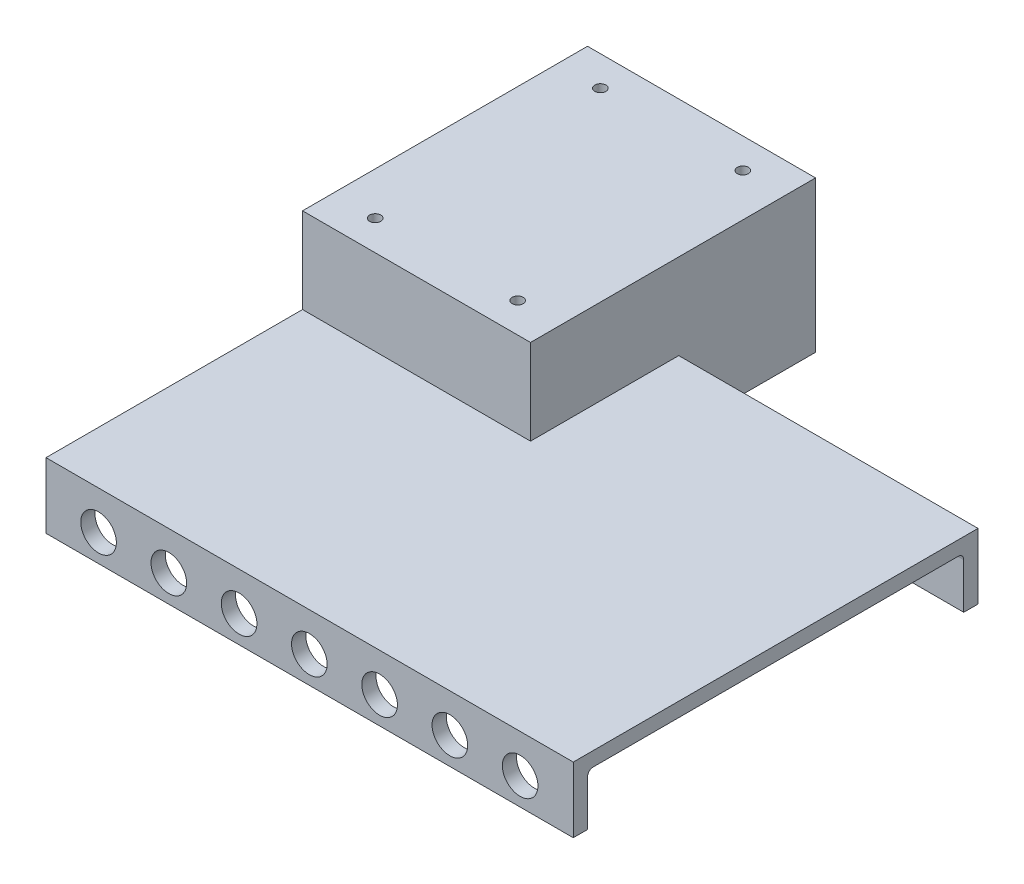
ISO-10303-21;
HEADER;
FILE_DESCRIPTION(('STEP AP214'),'2;1');
FILE_NAME('part.step','',(''),(''),'','','');
FILE_SCHEMA(('AUTOMOTIVE_DESIGN { 1 0 10303 214 1 1 1 1 }'));
ENDSEC;
DATA;
#1=APPLICATION_CONTEXT('core data for automotive mechanical design processes');
#2=APPLICATION_PROTOCOL_DEFINITION('international standard','automotive_design',2000,#1);
#3=PRODUCT_CONTEXT('',#1,'mechanical');
#4=PRODUCT('Part','Part','',(#3));
#5=PRODUCT_RELATED_PRODUCT_CATEGORY('part','',(#4));
#6=PRODUCT_DEFINITION_FORMATION('','',#4);
#7=PRODUCT_DEFINITION_CONTEXT('part definition',#1,'design');
#8=PRODUCT_DEFINITION('design','',#6,#7);
#9=PRODUCT_DEFINITION_SHAPE('','',#8);
#10=(LENGTH_UNIT() NAMED_UNIT(*) SI_UNIT(.MILLI.,.METRE.));
#11=(NAMED_UNIT(*) PLANE_ANGLE_UNIT() SI_UNIT($,.RADIAN.));
#12=(NAMED_UNIT(*) SI_UNIT($,.STERADIAN.) SOLID_ANGLE_UNIT());
#13=UNCERTAINTY_MEASURE_WITH_UNIT(LENGTH_MEASURE(1.E-05),#10,'distance_accuracy_value','');
#14=(GEOMETRIC_REPRESENTATION_CONTEXT(3) GLOBAL_UNCERTAINTY_ASSIGNED_CONTEXT((#13)) GLOBAL_UNIT_ASSIGNED_CONTEXT((#10,
#11,#12)) REPRESENTATION_CONTEXT('',''));
#15=CARTESIAN_POINT('',(0.,0.,0.));
#16=DIRECTION('',(0.,0.,1.));
#17=DIRECTION('',(1.,0.,0.));
#18=AXIS2_PLACEMENT_3D('',#15,#16,#17);
#19=CARTESIAN_POINT('',(0.,23.,0.));
#20=DIRECTION('',(1.,0.,0.));
#21=DIRECTION('',(0.,0.,-1.));
#22=AXIS2_PLACEMENT_3D('',#19,#20,#21);
#23=PLANE('',#22);
#24=DIRECTION('',(0.,-1.,0.));
#25=VECTOR('',#24,1.);
#26=CARTESIAN_POINT('',(0.,23.,-185.));
#27=LINE('',#26,#25);
#28=CARTESIAN_POINT('',(0.,46.,-185.));
#29=VERTEX_POINT('',#28);
#30=CARTESIAN_POINT('',(0.,0.,-185.));
#31=VERTEX_POINT('',#30);
#32=EDGE_CURVE('E223',#29,#31,#27,.T.);
#33=ORIENTED_EDGE('',*,*,#32,.F.);
#34=CARTESIAN_POINT('',(0.,46.,-183.));
#35=DIRECTION('',(1.,0.,0.));
#36=DIRECTION('',(0.,0.,-1.));
#37=AXIS2_PLACEMENT_3D('',#34,#35,#36);
#38=CIRCLE('',#37,2.);
#39=CARTESIAN_POINT('',(0.,48.,-183.));
#40=VERTEX_POINT('',#39);
#41=EDGE_CURVE('E354',#29,#40,#38,.T.);
#42=ORIENTED_EDGE('',*,*,#41,.T.);
#43=DIRECTION('',(0.,0.,1.));
#44=VECTOR('',#43,1.);
#45=CARTESIAN_POINT('',(0.,48.,0.));
#46=LINE('',#45,#44);
#47=CARTESIAN_POINT('',(0.,48.,-97.));
#48=VERTEX_POINT('',#47);
#49=EDGE_CURVE('E235',#40,#48,#46,.T.);
#50=ORIENTED_EDGE('',*,*,#49,.T.);
#51=CARTESIAN_POINT('',(0.,46.,-97.));
#52=DIRECTION('',(1.,0.,0.));
#53=DIRECTION('',(0.,0.,-1.));
#54=AXIS2_PLACEMENT_3D('',#51,#52,#53);
#55=CIRCLE('',#54,2.);
#56=CARTESIAN_POINT('',(0.,46.,-95.));
#57=VERTEX_POINT('',#56);
#58=EDGE_CURVE('E352',#48,#57,#55,.T.);
#59=ORIENTED_EDGE('',*,*,#58,.T.);
#60=DIRECTION('',(0.,-1.,0.));
#61=VECTOR('',#60,1.);
#62=CARTESIAN_POINT('',(0.,53.,-95.));
#63=LINE('',#62,#61);
#64=CARTESIAN_POINT('',(0.,18.,-95.));
#65=VERTEX_POINT('',#64);
#66=EDGE_CURVE('E202',#57,#65,#63,.T.);
#67=ORIENTED_EDGE('',*,*,#66,.T.);
#68=DIRECTION('',(0.,0.,1.));
#69=VECTOR('',#68,1.);
#70=CARTESIAN_POINT('',(0.,18.,0.));
#71=LINE('',#70,#69);
#72=CARTESIAN_POINT('',(0.,18.,-7.));
#73=VERTEX_POINT('',#72);
#74=EDGE_CURVE('E213',#65,#73,#71,.T.);
#75=ORIENTED_EDGE('',*,*,#74,.T.);
#76=CARTESIAN_POINT('',(0.,16.,-7.));
#77=DIRECTION('',(1.,0.,0.));
#78=DIRECTION('',(0.,0.,-1.));
#79=AXIS2_PLACEMENT_3D('',#76,#77,#78);
#80=CIRCLE('',#79,2.);
#81=CARTESIAN_POINT('',(0.,16.,-5.));
#82=VERTEX_POINT('',#81);
#83=EDGE_CURVE('E358',#73,#82,#80,.T.);
#84=ORIENTED_EDGE('',*,*,#83,.T.);
#85=DIRECTION('',(0.,-1.,0.));
#86=VECTOR('',#85,1.);
#87=CARTESIAN_POINT('',(0.,23.,-5.));
#88=LINE('',#87,#86);
#89=CARTESIAN_POINT('',(0.,0.,-5.));
#90=VERTEX_POINT('',#89);
#91=EDGE_CURVE('E229',#82,#90,#88,.T.);
#92=ORIENTED_EDGE('',*,*,#91,.T.);
#93=DIRECTION('',(0.,0.,1.));
#94=VECTOR('',#93,1.);
#95=CARTESIAN_POINT('',(0.,0.,0.));
#96=LINE('',#95,#94);
#97=CARTESIAN_POINT('',(0.,0.,0.));
#98=VERTEX_POINT('',#97);
#99=EDGE_CURVE('E282',#90,#98,#96,.T.);
#100=ORIENTED_EDGE('',*,*,#99,.T.);
#101=DIRECTION('',(0.,-1.,0.));
#102=VECTOR('',#101,1.);
#103=CARTESIAN_POINT('',(0.,23.,0.));
#104=LINE('',#103,#102);
#105=CARTESIAN_POINT('',(0.,23.,0.));
#106=VERTEX_POINT('',#105);
#107=EDGE_CURVE('E308',#106,#98,#104,.T.);
#108=ORIENTED_EDGE('',*,*,#107,.F.);
#109=DIRECTION('',(0.,0.,1.));
#110=VECTOR('',#109,1.);
#111=CARTESIAN_POINT('',(0.,23.,0.));
#112=LINE('',#111,#110);
#113=CARTESIAN_POINT('',(0.,23.,-90.));
#114=VERTEX_POINT('',#113);
#115=EDGE_CURVE('E283',#114,#106,#112,.T.);
#116=ORIENTED_EDGE('',*,*,#115,.F.);
#117=DIRECTION('',(0.,-1.,0.));
#118=VECTOR('',#117,1.);
#119=CARTESIAN_POINT('',(0.,53.,-90.));
#120=LINE('',#119,#118);
#121=CARTESIAN_POINT('',(0.,53.,-90.));
#122=VERTEX_POINT('',#121);
#123=EDGE_CURVE('E270',#122,#114,#120,.T.);
#124=ORIENTED_EDGE('',*,*,#123,.F.);
#125=DIRECTION('',(0.,0.,1.));
#126=VECTOR('',#125,1.);
#127=CARTESIAN_POINT('',(0.,53.,-90.));
#128=LINE('',#127,#126);
#129=CARTESIAN_POINT('',(0.,53.,-190.));
#130=VERTEX_POINT('',#129);
#131=EDGE_CURVE('E248',#130,#122,#128,.T.);
#132=ORIENTED_EDGE('',*,*,#131,.F.);
#133=DIRECTION('',(0.,-1.,0.));
#134=VECTOR('',#133,1.);
#135=CARTESIAN_POINT('',(0.,53.,-190.));
#136=LINE('',#135,#134);
#137=CARTESIAN_POINT('',(0.,0.,-190.));
#138=VERTEX_POINT('',#137);
#139=EDGE_CURVE('E258',#130,#138,#136,.T.);
#140=ORIENTED_EDGE('',*,*,#139,.T.);
#141=EDGE_CURVE('E293',#138,#31,#96,.T.);
#142=ORIENTED_EDGE('',*,*,#141,.T.);
#143=EDGE_LOOP('',(#33,#42,#50,#59,#67,#75,#84,#92,#100,#108,#116,#124,#132,#140,#142));
#144=FACE_BOUND('',#143,.T.);
#145=ADVANCED_FACE('F51',(#144),#23,.F.);
#146=CARTESIAN_POINT('',(0.,0.,0.));
#147=DIRECTION('',(0.,-1.,0.));
#148=DIRECTION('',(0.,0.,-1.));
#149=AXIS2_PLACEMENT_3D('',#146,#147,#148);
#150=PLANE('',#149);
#151=ORIENTED_EDGE('',*,*,#99,.F.);
#152=DIRECTION('',(1.,0.,0.));
#153=VECTOR('',#152,1.);
#154=CARTESIAN_POINT('',(0.,0.,-5.));
#155=LINE('',#154,#153);
#156=CARTESIAN_POINT('',(185.,0.,-5.));
#157=VERTEX_POINT('',#156);
#158=EDGE_CURVE('E214',#90,#157,#155,.T.);
#159=ORIENTED_EDGE('',*,*,#158,.T.);
#160=DIRECTION('',(0.,0.,-1.));
#161=VECTOR('',#160,1.);
#162=CARTESIAN_POINT('',(185.,0.,0.));
#163=LINE('',#162,#161);
#164=CARTESIAN_POINT('',(185.,0.,0.));
#165=VERTEX_POINT('',#164);
#166=EDGE_CURVE('E299',#165,#157,#163,.T.);
#167=ORIENTED_EDGE('',*,*,#166,.F.);
#168=DIRECTION('',(1.,0.,0.));
#169=VECTOR('',#168,1.);
#170=CARTESIAN_POINT('',(0.,0.,0.));
#171=LINE('',#170,#169);
#172=EDGE_CURVE('E296',#98,#165,#171,.T.);
#173=ORIENTED_EDGE('',*,*,#172,.F.);
#174=EDGE_LOOP('',(#151,#159,#167,#173));
#175=FACE_BOUND('',#174,.T.);
#176=ADVANCED_FACE('F446',(#175),#150,.T.);
#177=DIRECTION('',(0.,0.,-1.));
#178=VECTOR('',#177,1.);
#179=CARTESIAN_POINT('',(75.,0.,0.));
#180=LINE('',#179,#178);
#181=CARTESIAN_POINT('',(75.,0.,-137.));
#182=VERTEX_POINT('',#181);
#183=CARTESIAN_POINT('',(75.,0.,-185.));
#184=VERTEX_POINT('',#183);
#185=EDGE_CURVE('E242',#182,#184,#180,.T.);
#186=ORIENTED_EDGE('',*,*,#185,.T.);
#187=DIRECTION('',(-1.,0.,0.));
#188=VECTOR('',#187,1.);
#189=CARTESIAN_POINT('',(0.,0.,-185.));
#190=LINE('',#189,#188);
#191=EDGE_CURVE('E238',#184,#31,#190,.T.);
#192=ORIENTED_EDGE('',*,*,#191,.T.);
#193=ORIENTED_EDGE('',*,*,#141,.F.);
#194=DIRECTION('',(-1.,0.,0.));
#195=VECTOR('',#194,1.);
#196=CARTESIAN_POINT('',(0.,0.,-190.));
#197=LINE('',#196,#195);
#198=CARTESIAN_POINT('',(80.,0.,-190.));
#199=VERTEX_POINT('',#198);
#200=EDGE_CURVE('E252',#199,#138,#197,.T.);
#201=ORIENTED_EDGE('',*,*,#200,.F.);
#202=DIRECTION('',(0.,0.,-1.));
#203=VECTOR('',#202,1.);
#204=CARTESIAN_POINT('',(80.,0.,-90.));
#205=LINE('',#204,#203);
#206=CARTESIAN_POINT('',(80.,0.,-142.));
#207=VERTEX_POINT('',#206);
#208=EDGE_CURVE('E232',#207,#199,#205,.T.);
#209=ORIENTED_EDGE('',*,*,#208,.F.);
#210=DIRECTION('',(-1.,0.,0.));
#211=VECTOR('',#210,1.);
#212=CARTESIAN_POINT('',(0.,0.,-142.));
#213=LINE('',#212,#211);
#214=CARTESIAN_POINT('',(185.,0.,-142.));
#215=VERTEX_POINT('',#214);
#216=EDGE_CURVE('E286',#215,#207,#213,.T.);
#217=ORIENTED_EDGE('',*,*,#216,.F.);
#218=CARTESIAN_POINT('',(185.,0.,-137.));
#219=VERTEX_POINT('',#218);
#220=EDGE_CURVE('E298',#219,#215,#163,.T.);
#221=ORIENTED_EDGE('',*,*,#220,.F.);
#222=DIRECTION('',(-1.,0.,0.));
#223=VECTOR('',#222,1.);
#224=CARTESIAN_POINT('',(0.,0.,-137.));
#225=LINE('',#224,#223);
#226=EDGE_CURVE('E217',#219,#182,#225,.T.);
#227=ORIENTED_EDGE('',*,*,#226,.T.);
#228=EDGE_LOOP('',(#186,#192,#193,#201,#209,#217,#221,#227));
#229=FACE_BOUND('',#228,.T.);
#230=ADVANCED_FACE('F412',(#229),#150,.T.);
#231=CARTESIAN_POINT('',(0.,23.,-142.));
#232=DIRECTION('',(0.,0.,1.));
#233=DIRECTION('',(1.,0.,0.));
#234=AXIS2_PLACEMENT_3D('',#231,#232,#233);
#235=PLANE('',#234);
#236=DIRECTION('',(0.,-1.,0.));
#237=VECTOR('',#236,1.);
#238=CARTESIAN_POINT('',(80.,23.,-142.));
#239=LINE('',#238,#237);
#240=CARTESIAN_POINT('',(80.,23.,-142.));
#241=VERTEX_POINT('',#240);
#242=EDGE_CURVE('E276',#241,#207,#239,.T.);
#243=ORIENTED_EDGE('',*,*,#242,.F.);
#244=DIRECTION('',(-1.,0.,0.));
#245=VECTOR('',#244,1.);
#246=CARTESIAN_POINT('',(0.,23.,-142.));
#247=LINE('',#246,#245);
#248=CARTESIAN_POINT('',(185.,23.,-142.));
#249=VERTEX_POINT('',#248);
#250=EDGE_CURVE('E290',#249,#241,#247,.T.);
#251=ORIENTED_EDGE('',*,*,#250,.F.);
#252=DIRECTION('',(0.,-1.,0.));
#253=VECTOR('',#252,1.);
#254=CARTESIAN_POINT('',(185.,23.,-142.));
#255=LINE('',#254,#253);
#256=EDGE_CURVE('E292',#249,#215,#255,.T.);
#257=ORIENTED_EDGE('',*,*,#256,.T.);
#258=ORIENTED_EDGE('',*,*,#216,.T.);
#259=EDGE_LOOP('',(#243,#251,#257,#258));
#260=FACE_BOUND('',#259,.T.);
#261=ADVANCED_FACE('F462',(#260),#235,.F.);
#262=CARTESIAN_POINT('',(0.,23.,0.));
#263=DIRECTION('',(0.,-1.,0.));
#264=DIRECTION('',(0.,0.,-1.));
#265=AXIS2_PLACEMENT_3D('',#262,#263,#264);
#266=PLANE('',#265);
#267=DIRECTION('',(1.,0.,0.));
#268=VECTOR('',#267,1.);
#269=CARTESIAN_POINT('',(0.,23.,-90.));
#270=LINE('',#269,#268);
#271=CARTESIAN_POINT('',(80.,23.,-90.));
#272=VERTEX_POINT('',#271);
#273=EDGE_CURVE('E279',#114,#272,#270,.T.);
#274=ORIENTED_EDGE('',*,*,#273,.F.);
#275=ORIENTED_EDGE('',*,*,#115,.T.);
#276=DIRECTION('',(1.,0.,0.));
#277=VECTOR('',#276,1.);
#278=CARTESIAN_POINT('',(0.,23.,0.));
#279=LINE('',#278,#277);
#280=CARTESIAN_POINT('',(185.,23.,0.));
#281=VERTEX_POINT('',#280);
#282=EDGE_CURVE('E285',#106,#281,#279,.T.);
#283=ORIENTED_EDGE('',*,*,#282,.T.);
#284=DIRECTION('',(0.,0.,-1.));
#285=VECTOR('',#284,1.);
#286=CARTESIAN_POINT('',(185.,23.,0.));
#287=LINE('',#286,#285);
#288=EDGE_CURVE('E288',#281,#249,#287,.T.);
#289=ORIENTED_EDGE('',*,*,#288,.T.);
#290=ORIENTED_EDGE('',*,*,#250,.T.);
#291=DIRECTION('',(0.,0.,-1.));
#292=VECTOR('',#291,1.);
#293=CARTESIAN_POINT('',(80.,23.,0.));
#294=LINE('',#293,#292);
#295=EDGE_CURVE('E273',#272,#241,#294,.T.);
#296=ORIENTED_EDGE('',*,*,#295,.F.);
#297=EDGE_LOOP('',(#274,#275,#283,#289,#290,#296));
#298=FACE_BOUND('',#297,.T.);
#299=ADVANCED_FACE('F458',(#298),#266,.F.);
#300=CARTESIAN_POINT('',(0.,23.,0.));
#301=DIRECTION('',(0.,0.,-1.));
#302=DIRECTION('',(-1.,0.,0.));
#303=AXIS2_PLACEMENT_3D('',#300,#301,#302);
#304=PLANE('',#303);
#305=CARTESIAN_POINT('',(166.345613164055,9.5,0.));
#306=DIRECTION('',(0.,0.,1.));
#307=DIRECTION('',(1.,0.,0.));
#308=AXIS2_PLACEMENT_3D('',#305,#306,#307);
#309=CIRCLE('',#308,6.25);
#310=CARTESIAN_POINT('',(172.595613164055,9.5,0.));
#311=VERTEX_POINT('',#310);
#312=EDGE_CURVE('E366',#311,#311,#309,.T.);
#313=ORIENTED_EDGE('',*,*,#312,.F.);
#314=EDGE_LOOP('',(#313));
#315=FACE_BOUND('',#314,.T.);
#316=CARTESIAN_POINT('',(141.694260970046,9.5,0.));
#317=DIRECTION('',(0.,0.,1.));
#318=DIRECTION('',(1.,0.,0.));
#319=AXIS2_PLACEMENT_3D('',#316,#317,#318);
#320=CIRCLE('',#319,6.25);
#321=CARTESIAN_POINT('',(147.944260970046,9.5,0.));
#322=VERTEX_POINT('',#321);
#323=EDGE_CURVE('E559',#322,#322,#320,.T.);
#324=ORIENTED_EDGE('',*,*,#323,.F.);
#325=EDGE_LOOP('',(#324));
#326=FACE_BOUND('',#325,.T.);
#327=CARTESIAN_POINT('',(67.7402043880185,9.5,0.));
#328=DIRECTION('',(0.,0.,1.));
#329=DIRECTION('',(1.,0.,0.));
#330=AXIS2_PLACEMENT_3D('',#327,#328,#329);
#331=CIRCLE('',#330,6.25);
#332=CARTESIAN_POINT('',(73.9902043880185,9.5,0.));
#333=VERTEX_POINT('',#332);
#334=EDGE_CURVE('E560',#333,#333,#331,.T.);
#335=ORIENTED_EDGE('',*,*,#334,.F.);
#336=EDGE_LOOP('',(#335));
#337=FACE_BOUND('',#336,.T.);
#338=CARTESIAN_POINT('',(92.3915565820277,9.5,0.));
#339=DIRECTION('',(0.,0.,1.));
#340=DIRECTION('',(1.,0.,0.));
#341=AXIS2_PLACEMENT_3D('',#338,#339,#340);
#342=CIRCLE('',#341,6.25);
#343=CARTESIAN_POINT('',(98.6415565820277,9.5,0.));
#344=VERTEX_POINT('',#343);
#345=EDGE_CURVE('E555',#344,#344,#342,.T.);
#346=ORIENTED_EDGE('',*,*,#345,.F.);
#347=EDGE_LOOP('',(#346));
#348=FACE_BOUND('',#347,.T.);
#349=CARTESIAN_POINT('',(117.042908776037,9.5,0.));
#350=DIRECTION('',(0.,0.,1.));
#351=DIRECTION('',(1.,0.,0.));
#352=AXIS2_PLACEMENT_3D('',#349,#350,#351);
#353=CIRCLE('',#352,6.25);
#354=CARTESIAN_POINT('',(123.292908776037,9.5,0.));
#355=VERTEX_POINT('',#354);
#356=EDGE_CURVE('E552',#355,#355,#353,.T.);
#357=ORIENTED_EDGE('',*,*,#356,.F.);
#358=EDGE_LOOP('',(#357));
#359=FACE_BOUND('',#358,.T.);
#360=CARTESIAN_POINT('',(18.4375,9.5,0.));
#361=DIRECTION('',(0.,0.,1.));
#362=DIRECTION('',(1.,0.,0.));
#363=AXIS2_PLACEMENT_3D('',#360,#361,#362);
#364=CIRCLE('',#363,6.25);
#365=CARTESIAN_POINT('',(24.6875,9.5,0.));
#366=VERTEX_POINT('',#365);
#367=EDGE_CURVE('E556',#366,#366,#364,.T.);
#368=ORIENTED_EDGE('',*,*,#367,.F.);
#369=EDGE_LOOP('',(#368));
#370=FACE_BOUND('',#369,.T.);
#371=CARTESIAN_POINT('',(43.0888521940092,9.5,0.));
#372=DIRECTION('',(0.,0.,1.));
#373=DIRECTION('',(1.,0.,0.));
#374=AXIS2_PLACEMENT_3D('',#371,#372,#373);
#375=CIRCLE('',#374,6.25000000000001);
#376=CARTESIAN_POINT('',(49.3388521940092,9.5,0.));
#377=VERTEX_POINT('',#376);
#378=EDGE_CURVE('E316',#377,#377,#375,.T.);
#379=ORIENTED_EDGE('',*,*,#378,.F.);
#380=EDGE_LOOP('',(#379));
#381=FACE_BOUND('',#380,.T.);
#382=ORIENTED_EDGE('',*,*,#172,.T.);
#383=DIRECTION('',(0.,-1.,0.));
#384=VECTOR('',#383,1.);
#385=CARTESIAN_POINT('',(185.,23.,0.));
#386=LINE('',#385,#384);
#387=EDGE_CURVE('E305',#281,#165,#386,.T.);
#388=ORIENTED_EDGE('',*,*,#387,.F.);
#389=ORIENTED_EDGE('',*,*,#282,.F.);
#390=ORIENTED_EDGE('',*,*,#107,.T.);
#391=EDGE_LOOP('',(#382,#388,#389,#390));
#392=FACE_BOUND('',#391,.T.);
#393=ADVANCED_FACE('F455',(#315,#326,#337,#348,#359,#370,#381,#392),#304,.F.);
#394=CARTESIAN_POINT('',(185.,23.,0.));
#395=DIRECTION('',(-1.,0.,0.));
#396=DIRECTION('',(0.,0.,1.));
#397=AXIS2_PLACEMENT_3D('',#394,#395,#396);
#398=PLANE('',#397);
#399=DIRECTION('',(0.,-1.,0.));
#400=VECTOR('',#399,1.);
#401=CARTESIAN_POINT('',(185.,23.,-5.));
#402=LINE('',#401,#400);
#403=CARTESIAN_POINT('',(185.,16.,-5.));
#404=VERTEX_POINT('',#403);
#405=EDGE_CURVE('E226',#404,#157,#402,.T.);
#406=ORIENTED_EDGE('',*,*,#405,.F.);
#407=CARTESIAN_POINT('',(185.,16.,-7.));
#408=DIRECTION('',(-1.,0.,0.));
#409=DIRECTION('',(0.,0.,1.));
#410=AXIS2_PLACEMENT_3D('',#407,#408,#409);
#411=CIRCLE('',#410,2.);
#412=CARTESIAN_POINT('',(185.,18.,-7.));
#413=VERTEX_POINT('',#412);
#414=EDGE_CURVE('E356',#404,#413,#411,.T.);
#415=ORIENTED_EDGE('',*,*,#414,.T.);
#416=DIRECTION('',(0.,0.,-1.));
#417=VECTOR('',#416,1.);
#418=CARTESIAN_POINT('',(185.,18.,0.));
#419=LINE('',#418,#417);
#420=CARTESIAN_POINT('',(185.,18.,-135.));
#421=VERTEX_POINT('',#420);
#422=EDGE_CURVE('E227',#413,#421,#419,.T.);
#423=ORIENTED_EDGE('',*,*,#422,.T.);
#424=CARTESIAN_POINT('',(185.,16.,-135.));
#425=DIRECTION('',(-1.,0.,0.));
#426=DIRECTION('',(0.,0.,1.));
#427=AXIS2_PLACEMENT_3D('',#424,#425,#426);
#428=CIRCLE('',#427,2.);
#429=CARTESIAN_POINT('',(185.,16.,-137.));
#430=VERTEX_POINT('',#429);
#431=EDGE_CURVE('E11',#421,#430,#428,.T.);
#432=ORIENTED_EDGE('',*,*,#431,.T.);
#433=DIRECTION('',(0.,-1.,0.));
#434=VECTOR('',#433,1.);
#435=CARTESIAN_POINT('',(185.,23.,-137.));
#436=LINE('',#435,#434);
#437=EDGE_CURVE('E224',#430,#219,#436,.T.);
#438=ORIENTED_EDGE('',*,*,#437,.T.);
#439=ORIENTED_EDGE('',*,*,#220,.T.);
#440=ORIENTED_EDGE('',*,*,#256,.F.);
#441=ORIENTED_EDGE('',*,*,#288,.F.);
#442=ORIENTED_EDGE('',*,*,#387,.T.);
#443=ORIENTED_EDGE('',*,*,#166,.T.);
#444=EDGE_LOOP('',(#406,#415,#423,#432,#438,#439,#440,#441,#442,#443));
#445=FACE_BOUND('',#444,.T.);
#446=ADVANCED_FACE('F420',(#445),#398,.F.);
#447=CARTESIAN_POINT('',(0.,53.,-90.));
#448=DIRECTION('',(0.,0.,-1.));
#449=DIRECTION('',(-1.,0.,0.));
#450=AXIS2_PLACEMENT_3D('',#447,#448,#449);
#451=PLANE('',#450);
#452=ORIENTED_EDGE('',*,*,#123,.T.);
#453=ORIENTED_EDGE('',*,*,#273,.T.);
#454=DIRECTION('',(0.,-1.,0.));
#455=VECTOR('',#454,1.);
#456=CARTESIAN_POINT('',(80.,53.,-90.));
#457=LINE('',#456,#455);
#458=CARTESIAN_POINT('',(80.,53.,-90.));
#459=VERTEX_POINT('',#458);
#460=EDGE_CURVE('E267',#459,#272,#457,.T.);
#461=ORIENTED_EDGE('',*,*,#460,.F.);
#462=DIRECTION('',(1.,0.,0.));
#463=VECTOR('',#462,1.);
#464=CARTESIAN_POINT('',(0.,53.,-90.));
#465=LINE('',#464,#463);
#466=EDGE_CURVE('E251',#122,#459,#465,.T.);
#467=ORIENTED_EDGE('',*,*,#466,.F.);
#468=EDGE_LOOP('',(#452,#453,#461,#467));
#469=FACE_BOUND('',#468,.T.);
#470=ADVANCED_FACE('F461',(#469),#451,.F.);
#471=CARTESIAN_POINT('',(80.,53.,-90.));
#472=DIRECTION('',(-1.,0.,0.));
#473=DIRECTION('',(0.,0.,1.));
#474=AXIS2_PLACEMENT_3D('',#471,#472,#473);
#475=PLANE('',#474);
#476=ORIENTED_EDGE('',*,*,#295,.T.);
#477=ORIENTED_EDGE('',*,*,#242,.T.);
#478=ORIENTED_EDGE('',*,*,#208,.T.);
#479=DIRECTION('',(0.,-1.,0.));
#480=VECTOR('',#479,1.);
#481=CARTESIAN_POINT('',(80.,53.,-190.));
#482=LINE('',#481,#480);
#483=CARTESIAN_POINT('',(80.,53.,-190.));
#484=VERTEX_POINT('',#483);
#485=EDGE_CURVE('E264',#484,#199,#482,.T.);
#486=ORIENTED_EDGE('',*,*,#485,.F.);
#487=DIRECTION('',(0.,0.,-1.));
#488=VECTOR('',#487,1.);
#489=CARTESIAN_POINT('',(80.,53.,-90.));
#490=LINE('',#489,#488);
#491=EDGE_CURVE('E254',#459,#484,#490,.T.);
#492=ORIENTED_EDGE('',*,*,#491,.F.);
#493=ORIENTED_EDGE('',*,*,#460,.T.);
#494=EDGE_LOOP('',(#476,#477,#478,#486,#492,#493));
#495=FACE_BOUND('',#494,.T.);
#496=ADVANCED_FACE('F471',(#495),#475,.F.);
#497=CARTESIAN_POINT('',(0.,53.,-190.));
#498=DIRECTION('',(0.,0.,1.));
#499=DIRECTION('',(1.,0.,0.));
#500=AXIS2_PLACEMENT_3D('',#497,#498,#499);
#501=PLANE('',#500);
#502=ORIENTED_EDGE('',*,*,#200,.T.);
#503=ORIENTED_EDGE('',*,*,#139,.F.);
#504=DIRECTION('',(-1.,0.,0.));
#505=VECTOR('',#504,1.);
#506=CARTESIAN_POINT('',(0.,53.,-190.));
#507=LINE('',#506,#505);
#508=EDGE_CURVE('E256',#484,#130,#507,.T.);
#509=ORIENTED_EDGE('',*,*,#508,.F.);
#510=ORIENTED_EDGE('',*,*,#485,.T.);
#511=EDGE_LOOP('',(#502,#503,#509,#510));
#512=FACE_BOUND('',#511,.T.);
#513=ADVANCED_FACE('F475',(#512),#501,.F.);
#514=CARTESIAN_POINT('',(0.,53.,0.));
#515=DIRECTION('',(0.,-1.,0.));
#516=DIRECTION('',(0.,0.,-1.));
#517=AXIS2_PLACEMENT_3D('',#514,#515,#516);
#518=PLANE('',#517);
#519=CARTESIAN_POINT('',(65.,53.,-100.5));
#520=DIRECTION('',(0.,1.,0.));
#521=DIRECTION('',(0.,0.,1.));
#522=AXIS2_PLACEMENT_3D('',#519,#520,#521);
#523=CIRCLE('',#522,1.95);
#524=CARTESIAN_POINT('',(65.,53.,-98.55));
#525=VERTEX_POINT('',#524);
#526=EDGE_CURVE('E547',#525,#525,#523,.T.);
#527=ORIENTED_EDGE('',*,*,#526,.F.);
#528=EDGE_LOOP('',(#527));
#529=FACE_BOUND('',#528,.T.);
#530=CARTESIAN_POINT('',(65.,53.,-179.5));
#531=DIRECTION('',(0.,1.,0.));
#532=DIRECTION('',(0.,0.,1.));
#533=AXIS2_PLACEMENT_3D('',#530,#531,#532);
#534=CIRCLE('',#533,1.95000000000003);
#535=CARTESIAN_POINT('',(65.,53.,-177.55));
#536=VERTEX_POINT('',#535);
#537=EDGE_CURVE('E542',#536,#536,#534,.T.);
#538=ORIENTED_EDGE('',*,*,#537,.F.);
#539=EDGE_LOOP('',(#538));
#540=FACE_BOUND('',#539,.T.);
#541=CARTESIAN_POINT('',(15.,53.,-179.5));
#542=DIRECTION('',(0.,1.,0.));
#543=DIRECTION('',(0.,0.,1.));
#544=AXIS2_PLACEMENT_3D('',#541,#542,#543);
#545=CIRCLE('',#544,1.95);
#546=CARTESIAN_POINT('',(15.,53.,-177.55));
#547=VERTEX_POINT('',#546);
#548=EDGE_CURVE('E540',#547,#547,#545,.T.);
#549=ORIENTED_EDGE('',*,*,#548,.F.);
#550=EDGE_LOOP('',(#549));
#551=FACE_BOUND('',#550,.T.);
#552=CARTESIAN_POINT('',(15.,53.,-100.5));
#553=DIRECTION('',(0.,1.,0.));
#554=DIRECTION('',(0.,0.,1.));
#555=AXIS2_PLACEMENT_3D('',#552,#553,#554);
#556=CIRCLE('',#555,1.94999999999999);
#557=CARTESIAN_POINT('',(15.,53.,-98.55));
#558=VERTEX_POINT('',#557);
#559=EDGE_CURVE('E371',#558,#558,#556,.T.);
#560=ORIENTED_EDGE('',*,*,#559,.F.);
#561=EDGE_LOOP('',(#560));
#562=FACE_BOUND('',#561,.T.);
#563=ORIENTED_EDGE('',*,*,#131,.T.);
#564=ORIENTED_EDGE('',*,*,#466,.T.);
#565=ORIENTED_EDGE('',*,*,#491,.T.);
#566=ORIENTED_EDGE('',*,*,#508,.T.);
#567=EDGE_LOOP('',(#563,#564,#565,#566));
#568=FACE_BOUND('',#567,.T.);
#569=ADVANCED_FACE('F479',(#529,#540,#551,#562,#568),#518,.F.);
#570=CARTESIAN_POINT('',(0.,23.,-137.));
#571=DIRECTION('',(0.,0.,1.));
#572=DIRECTION('',(1.,0.,0.));
#573=AXIS2_PLACEMENT_3D('',#570,#571,#572);
#574=PLANE('',#573);
#575=ORIENTED_EDGE('',*,*,#437,.F.);
#576=DIRECTION('',(-1.,0.,0.));
#577=VECTOR('',#576,1.);
#578=CARTESIAN_POINT('',(75.,16.,-137.));
#579=LINE('',#578,#577);
#580=CARTESIAN_POINT('',(75.,16.,-137.));
#581=VERTEX_POINT('',#580);
#582=EDGE_CURVE('E349',#430,#581,#579,.T.);
#583=ORIENTED_EDGE('',*,*,#582,.T.);
#584=DIRECTION('',(0.,-1.,0.));
#585=VECTOR('',#584,1.);
#586=CARTESIAN_POINT('',(75.,23.,-137.));
#587=LINE('',#586,#585);
#588=EDGE_CURVE('E210',#581,#182,#587,.T.);
#589=ORIENTED_EDGE('',*,*,#588,.T.);
#590=ORIENTED_EDGE('',*,*,#226,.F.);
#591=EDGE_LOOP('',(#575,#583,#589,#590));
#592=FACE_BOUND('',#591,.T.);
#593=ADVANCED_FACE('F416',(#592),#574,.T.);
#594=CARTESIAN_POINT('',(0.,18.,0.));
#595=DIRECTION('',(0.,-1.,0.));
#596=DIRECTION('',(0.,0.,-1.));
#597=AXIS2_PLACEMENT_3D('',#594,#595,#596);
#598=PLANE('',#597);
#599=ORIENTED_EDGE('',*,*,#422,.F.);
#600=DIRECTION('',(1.,0.,0.));
#601=VECTOR('',#600,1.);
#602=CARTESIAN_POINT('',(0.,18.,-7.));
#603=LINE('',#602,#601);
#604=EDGE_CURVE('E74',#413,#73,#603,.F.);
#605=ORIENTED_EDGE('',*,*,#604,.T.);
#606=ORIENTED_EDGE('',*,*,#74,.F.);
#607=DIRECTION('',(1.,0.,0.));
#608=VECTOR('',#607,1.);
#609=CARTESIAN_POINT('',(0.,18.,-95.));
#610=LINE('',#609,#608);
#611=CARTESIAN_POINT('',(75.,18.,-95.));
#612=VERTEX_POINT('',#611);
#613=EDGE_CURVE('E196',#65,#612,#610,.T.);
#614=ORIENTED_EDGE('',*,*,#613,.T.);
#615=DIRECTION('',(0.,0.,-1.));
#616=VECTOR('',#615,1.);
#617=CARTESIAN_POINT('',(75.,18.,0.));
#618=LINE('',#617,#616);
#619=CARTESIAN_POINT('',(75.,18.,-135.));
#620=VERTEX_POINT('',#619);
#621=EDGE_CURVE('E206',#612,#620,#618,.T.);
#622=ORIENTED_EDGE('',*,*,#621,.T.);
#623=DIRECTION('',(-1.,0.,0.));
#624=VECTOR('',#623,1.);
#625=CARTESIAN_POINT('',(185.,18.,-135.));
#626=LINE('',#625,#624);
#627=EDGE_CURVE('E346',#620,#421,#626,.F.);
#628=ORIENTED_EDGE('',*,*,#627,.T.);
#629=EDGE_LOOP('',(#599,#605,#606,#614,#622,#628));
#630=FACE_BOUND('',#629,.T.);
#631=ADVANCED_FACE('F212',(#630),#598,.T.);
#632=CARTESIAN_POINT('',(0.,23.,-5.));
#633=DIRECTION('',(0.,0.,-1.));
#634=DIRECTION('',(-1.,0.,0.));
#635=AXIS2_PLACEMENT_3D('',#632,#633,#634);
#636=PLANE('',#635);
#637=CARTESIAN_POINT('',(166.345613164055,9.5,-5.));
#638=DIRECTION('',(0.,0.,-1.));
#639=DIRECTION('',(-1.,0.,0.));
#640=AXIS2_PLACEMENT_3D('',#637,#638,#639);
#641=CIRCLE('',#640,6.25);
#642=CARTESIAN_POINT('',(160.095613164055,9.5,-5.));
#643=VERTEX_POINT('',#642);
#644=EDGE_CURVE('E245',#643,#643,#641,.T.);
#645=ORIENTED_EDGE('',*,*,#644,.F.);
#646=EDGE_LOOP('',(#645));
#647=FACE_BOUND('',#646,.T.);
#648=CARTESIAN_POINT('',(141.694260970046,9.5,-5.));
#649=DIRECTION('',(0.,0.,-1.));
#650=DIRECTION('',(-1.,0.,0.));
#651=AXIS2_PLACEMENT_3D('',#648,#649,#650);
#652=CIRCLE('',#651,6.25);
#653=CARTESIAN_POINT('',(135.444260970046,9.5,-5.));
#654=VERTEX_POINT('',#653);
#655=EDGE_CURVE('E328',#654,#654,#652,.T.);
#656=ORIENTED_EDGE('',*,*,#655,.F.);
#657=EDGE_LOOP('',(#656));
#658=FACE_BOUND('',#657,.T.);
#659=CARTESIAN_POINT('',(67.7402043880185,9.5,-5.));
#660=DIRECTION('',(0.,0.,-1.));
#661=DIRECTION('',(-1.,0.,0.));
#662=AXIS2_PLACEMENT_3D('',#659,#660,#661);
#663=CIRCLE('',#662,6.25);
#664=CARTESIAN_POINT('',(61.4902043880185,9.5,-5.));
#665=VERTEX_POINT('',#664);
#666=EDGE_CURVE('E325',#665,#665,#663,.T.);
#667=ORIENTED_EDGE('',*,*,#666,.F.);
#668=EDGE_LOOP('',(#667));
#669=FACE_BOUND('',#668,.T.);
#670=CARTESIAN_POINT('',(92.3915565820277,9.5,-5.));
#671=DIRECTION('',(0.,0.,-1.));
#672=DIRECTION('',(-1.,0.,0.));
#673=AXIS2_PLACEMENT_3D('',#670,#671,#672);
#674=CIRCLE('',#673,6.25);
#675=CARTESIAN_POINT('',(86.1415565820277,9.5,-5.));
#676=VERTEX_POINT('',#675);
#677=EDGE_CURVE('E322',#676,#676,#674,.T.);
#678=ORIENTED_EDGE('',*,*,#677,.F.);
#679=EDGE_LOOP('',(#678));
#680=FACE_BOUND('',#679,.T.);
#681=CARTESIAN_POINT('',(117.042908776037,9.5,-5.));
#682=DIRECTION('',(0.,0.,-1.));
#683=DIRECTION('',(-1.,0.,0.));
#684=AXIS2_PLACEMENT_3D('',#681,#682,#683);
#685=CIRCLE('',#684,6.25);
#686=CARTESIAN_POINT('',(110.792908776037,9.5,-5.));
#687=VERTEX_POINT('',#686);
#688=EDGE_CURVE('E319',#687,#687,#685,.T.);
#689=ORIENTED_EDGE('',*,*,#688,.F.);
#690=EDGE_LOOP('',(#689));
#691=FACE_BOUND('',#690,.T.);
#692=CARTESIAN_POINT('',(18.4375,9.5,-5.));
#693=DIRECTION('',(0.,0.,-1.));
#694=DIRECTION('',(-1.,0.,0.));
#695=AXIS2_PLACEMENT_3D('',#692,#693,#694);
#696=CIRCLE('',#695,6.25);
#697=CARTESIAN_POINT('',(12.1875,9.5,-5.));
#698=VERTEX_POINT('',#697);
#699=EDGE_CURVE('E315',#698,#698,#696,.T.);
#700=ORIENTED_EDGE('',*,*,#699,.F.);
#701=EDGE_LOOP('',(#700));
#702=FACE_BOUND('',#701,.T.);
#703=CARTESIAN_POINT('',(43.0888521940092,9.5,-5.));
#704=DIRECTION('',(0.,0.,-1.));
#705=DIRECTION('',(-1.,0.,0.));
#706=AXIS2_PLACEMENT_3D('',#703,#704,#705);
#707=CIRCLE('',#706,6.25000000000001);
#708=CARTESIAN_POINT('',(36.8388521940092,9.5,-5.));
#709=VERTEX_POINT('',#708);
#710=EDGE_CURVE('E312',#709,#709,#707,.T.);
#711=ORIENTED_EDGE('',*,*,#710,.F.);
#712=EDGE_LOOP('',(#711));
#713=FACE_BOUND('',#712,.T.);
#714=ORIENTED_EDGE('',*,*,#91,.F.);
#715=DIRECTION('',(1.,0.,0.));
#716=VECTOR('',#715,1.);
#717=CARTESIAN_POINT('',(185.,16.,-5.));
#718=LINE('',#717,#716);
#719=EDGE_CURVE('E343',#82,#404,#718,.T.);
#720=ORIENTED_EDGE('',*,*,#719,.T.);
#721=ORIENTED_EDGE('',*,*,#405,.T.);
#722=ORIENTED_EDGE('',*,*,#158,.F.);
#723=EDGE_LOOP('',(#714,#720,#721,#722));
#724=FACE_BOUND('',#723,.T.);
#725=ADVANCED_FACE('F427',(#647,#658,#669,#680,#691,#702,#713,#724),#636,.T.);
#726=CARTESIAN_POINT('',(0.,53.,-95.));
#727=DIRECTION('',(0.,0.,-1.));
#728=DIRECTION('',(-1.,0.,0.));
#729=AXIS2_PLACEMENT_3D('',#726,#727,#728);
#730=PLANE('',#729);
#731=ORIENTED_EDGE('',*,*,#66,.F.);
#732=DIRECTION('',(1.,0.,0.));
#733=VECTOR('',#732,1.);
#734=CARTESIAN_POINT('',(75.,46.,-95.));
#735=LINE('',#734,#733);
#736=CARTESIAN_POINT('',(75.,46.,-95.));
#737=VERTEX_POINT('',#736);
#738=EDGE_CURVE('E198',#57,#737,#735,.T.);
#739=ORIENTED_EDGE('',*,*,#738,.T.);
#740=DIRECTION('',(0.,-1.,0.));
#741=VECTOR('',#740,1.);
#742=CARTESIAN_POINT('',(75.,53.,-95.));
#743=LINE('',#742,#741);
#744=EDGE_CURVE('E191',#737,#612,#743,.T.);
#745=ORIENTED_EDGE('',*,*,#744,.T.);
#746=ORIENTED_EDGE('',*,*,#613,.F.);
#747=EDGE_LOOP('',(#731,#739,#745,#746));
#748=FACE_BOUND('',#747,.T.);
#749=ADVANCED_FACE('F194',(#748),#730,.T.);
#750=CARTESIAN_POINT('',(75.,53.,-90.));
#751=DIRECTION('',(-1.,0.,0.));
#752=DIRECTION('',(0.,0.,1.));
#753=AXIS2_PLACEMENT_3D('',#750,#751,#752);
#754=PLANE('',#753);
#755=ORIENTED_EDGE('',*,*,#744,.F.);
#756=DIRECTION('',(0.,0.,-1.));
#757=VECTOR('',#756,1.);
#758=CARTESIAN_POINT('',(75.,46.,-185.));
#759=LINE('',#758,#757);
#760=CARTESIAN_POINT('',(75.,46.,-185.));
#761=VERTEX_POINT('',#760);
#762=EDGE_CURVE('E311',#737,#761,#759,.T.);
#763=ORIENTED_EDGE('',*,*,#762,.T.);
#764=DIRECTION('',(0.,-1.,0.));
#765=VECTOR('',#764,1.);
#766=CARTESIAN_POINT('',(75.,53.,-185.));
#767=LINE('',#766,#765);
#768=EDGE_CURVE('E203',#761,#184,#767,.T.);
#769=ORIENTED_EDGE('',*,*,#768,.T.);
#770=ORIENTED_EDGE('',*,*,#185,.F.);
#771=ORIENTED_EDGE('',*,*,#588,.F.);
#772=CARTESIAN_POINT('',(75.,16.,-135.));
#773=DIRECTION('',(-1.,0.,0.));
#774=DIRECTION('',(0.,0.,1.));
#775=AXIS2_PLACEMENT_3D('',#772,#773,#774);
#776=CIRCLE('',#775,2.);
#777=EDGE_CURVE('E60',#581,#620,#776,.F.);
#778=ORIENTED_EDGE('',*,*,#777,.T.);
#779=ORIENTED_EDGE('',*,*,#621,.F.);
#780=EDGE_LOOP('',(#755,#763,#769,#770,#771,#778,#779));
#781=FACE_BOUND('',#780,.T.);
#782=ADVANCED_FACE('F207',(#781),#754,.T.);
#783=CARTESIAN_POINT('',(0.,53.,-185.));
#784=DIRECTION('',(0.,0.,1.));
#785=DIRECTION('',(1.,0.,0.));
#786=AXIS2_PLACEMENT_3D('',#783,#784,#785);
#787=PLANE('',#786);
#788=ORIENTED_EDGE('',*,*,#768,.F.);
#789=DIRECTION('',(-1.,0.,0.));
#790=VECTOR('',#789,1.);
#791=CARTESIAN_POINT('',(0.,46.,-185.));
#792=LINE('',#791,#790);
#793=EDGE_CURVE('E341',#761,#29,#792,.T.);
#794=ORIENTED_EDGE('',*,*,#793,.T.);
#795=ORIENTED_EDGE('',*,*,#32,.T.);
#796=ORIENTED_EDGE('',*,*,#191,.F.);
#797=EDGE_LOOP('',(#788,#794,#795,#796));
#798=FACE_BOUND('',#797,.T.);
#799=ADVANCED_FACE('F387',(#798),#787,.T.);
#800=CARTESIAN_POINT('',(0.,48.,0.));
#801=DIRECTION('',(0.,-1.,0.));
#802=DIRECTION('',(0.,0.,-1.));
#803=AXIS2_PLACEMENT_3D('',#800,#801,#802);
#804=PLANE('',#803);
#805=CARTESIAN_POINT('',(65.,48.,-100.5));
#806=DIRECTION('',(0.,-1.,0.));
#807=DIRECTION('',(0.,0.,-1.));
#808=AXIS2_PLACEMENT_3D('',#805,#806,#807);
#809=CIRCLE('',#808,1.95);
#810=CARTESIAN_POINT('',(65.,48.,-102.45));
#811=VERTEX_POINT('',#810);
#812=EDGE_CURVE('E55',#811,#811,#809,.T.);
#813=ORIENTED_EDGE('',*,*,#812,.F.);
#814=EDGE_LOOP('',(#813));
#815=FACE_BOUND('',#814,.T.);
#816=CARTESIAN_POINT('',(65.,48.,-179.5));
#817=DIRECTION('',(0.,-1.,0.));
#818=DIRECTION('',(0.,0.,-1.));
#819=AXIS2_PLACEMENT_3D('',#816,#817,#818);
#820=CIRCLE('',#819,1.95000000000003);
#821=CARTESIAN_POINT('',(65.,48.,-181.45));
#822=VERTEX_POINT('',#821);
#823=EDGE_CURVE('E373',#822,#822,#820,.T.);
#824=ORIENTED_EDGE('',*,*,#823,.F.);
#825=EDGE_LOOP('',(#824));
#826=FACE_BOUND('',#825,.T.);
#827=CARTESIAN_POINT('',(15.,48.,-179.5));
#828=DIRECTION('',(0.,-1.,0.));
#829=DIRECTION('',(0.,0.,-1.));
#830=AXIS2_PLACEMENT_3D('',#827,#828,#829);
#831=CIRCLE('',#830,1.95);
#832=CARTESIAN_POINT('',(15.,48.,-181.45));
#833=VERTEX_POINT('',#832);
#834=EDGE_CURVE('E370',#833,#833,#831,.T.);
#835=ORIENTED_EDGE('',*,*,#834,.F.);
#836=EDGE_LOOP('',(#835));
#837=FACE_BOUND('',#836,.T.);
#838=CARTESIAN_POINT('',(15.,48.,-100.5));
#839=DIRECTION('',(0.,-1.,0.));
#840=DIRECTION('',(0.,0.,-1.));
#841=AXIS2_PLACEMENT_3D('',#838,#839,#840);
#842=CIRCLE('',#841,1.94999999999999);
#843=CARTESIAN_POINT('',(15.,48.,-102.45));
#844=VERTEX_POINT('',#843);
#845=EDGE_CURVE('E367',#844,#844,#842,.T.);
#846=ORIENTED_EDGE('',*,*,#845,.F.);
#847=EDGE_LOOP('',(#846));
#848=FACE_BOUND('',#847,.T.);
#849=DIRECTION('',(0.,0.,-1.));
#850=VECTOR('',#849,1.);
#851=CARTESIAN_POINT('',(73.,48.,-95.));
#852=LINE('',#851,#850);
#853=CARTESIAN_POINT('',(73.,48.,-183.));
#854=VERTEX_POINT('',#853);
#855=CARTESIAN_POINT('',(73.,48.,-97.));
#856=VERTEX_POINT('',#855);
#857=EDGE_CURVE('E336',#854,#856,#852,.F.);
#858=ORIENTED_EDGE('',*,*,#857,.T.);
#859=DIRECTION('',(1.,0.,0.));
#860=VECTOR('',#859,1.);
#861=CARTESIAN_POINT('',(0.,48.,-97.));
#862=LINE('',#861,#860);
#863=EDGE_CURVE('E338',#856,#48,#862,.F.);
#864=ORIENTED_EDGE('',*,*,#863,.T.);
#865=ORIENTED_EDGE('',*,*,#49,.F.);
#866=DIRECTION('',(-1.,0.,0.));
#867=VECTOR('',#866,1.);
#868=CARTESIAN_POINT('',(75.,48.,-183.));
#869=LINE('',#868,#867);
#870=EDGE_CURVE('E334',#40,#854,#869,.F.);
#871=ORIENTED_EDGE('',*,*,#870,.T.);
#872=EDGE_LOOP('',(#858,#864,#865,#871));
#873=FACE_BOUND('',#872,.T.);
#874=ADVANCED_FACE('F383',(#815,#826,#837,#848,#873),#804,.T.);
#875=CARTESIAN_POINT('',(43.0888521940092,9.5,-6.));
#876=DIRECTION('',(0.,0.,1.));
#877=DIRECTION('',(1.,0.,0.));
#878=AXIS2_PLACEMENT_3D('',#875,#876,#877);
#879=CYLINDRICAL_SURFACE('',#878,6.25000000000001);
#880=ORIENTED_EDGE('',*,*,#710,.T.);
#881=EDGE_LOOP('',(#880));
#882=FACE_BOUND('',#881,.T.);
#883=ORIENTED_EDGE('',*,*,#378,.T.);
#884=EDGE_LOOP('',(#883));
#885=FACE_BOUND('',#884,.T.);
#886=ADVANCED_FACE('F386',(#882,#885),#879,.F.);
#887=CARTESIAN_POINT('',(18.4375,9.5,-6.));
#888=DIRECTION('',(0.,0.,1.));
#889=DIRECTION('',(1.,0.,0.));
#890=AXIS2_PLACEMENT_3D('',#887,#888,#889);
#891=CYLINDRICAL_SURFACE('',#890,6.25);
#892=ORIENTED_EDGE('',*,*,#699,.T.);
#893=EDGE_LOOP('',(#892));
#894=FACE_BOUND('',#893,.T.);
#895=ORIENTED_EDGE('',*,*,#367,.T.);
#896=EDGE_LOOP('',(#895));
#897=FACE_BOUND('',#896,.T.);
#898=ADVANCED_FACE('F499',(#894,#897),#891,.F.);
#899=CARTESIAN_POINT('',(117.042908776037,9.5,-6.));
#900=DIRECTION('',(0.,0.,1.));
#901=DIRECTION('',(1.,0.,0.));
#902=AXIS2_PLACEMENT_3D('',#899,#900,#901);
#903=CYLINDRICAL_SURFACE('',#902,6.25);
#904=ORIENTED_EDGE('',*,*,#688,.T.);
#905=EDGE_LOOP('',(#904));
#906=FACE_BOUND('',#905,.T.);
#907=ORIENTED_EDGE('',*,*,#356,.T.);
#908=EDGE_LOOP('',(#907));
#909=FACE_BOUND('',#908,.T.);
#910=ADVANCED_FACE('F512',(#906,#909),#903,.F.);
#911=CARTESIAN_POINT('',(92.3915565820277,9.5,-6.));
#912=DIRECTION('',(0.,0.,1.));
#913=DIRECTION('',(1.,0.,0.));
#914=AXIS2_PLACEMENT_3D('',#911,#912,#913);
#915=CYLINDRICAL_SURFACE('',#914,6.25);
#916=ORIENTED_EDGE('',*,*,#677,.T.);
#917=EDGE_LOOP('',(#916));
#918=FACE_BOUND('',#917,.T.);
#919=ORIENTED_EDGE('',*,*,#345,.T.);
#920=EDGE_LOOP('',(#919));
#921=FACE_BOUND('',#920,.T.);
#922=ADVANCED_FACE('F509',(#918,#921),#915,.F.);
#923=CARTESIAN_POINT('',(67.7402043880185,9.5,-6.));
#924=DIRECTION('',(0.,0.,1.));
#925=DIRECTION('',(1.,0.,0.));
#926=AXIS2_PLACEMENT_3D('',#923,#924,#925);
#927=CYLINDRICAL_SURFACE('',#926,6.25);
#928=ORIENTED_EDGE('',*,*,#666,.T.);
#929=EDGE_LOOP('',(#928));
#930=FACE_BOUND('',#929,.T.);
#931=ORIENTED_EDGE('',*,*,#334,.T.);
#932=EDGE_LOOP('',(#931));
#933=FACE_BOUND('',#932,.T.);
#934=ADVANCED_FACE('F507',(#930,#933),#927,.F.);
#935=CARTESIAN_POINT('',(141.694260970046,9.5,-6.));
#936=DIRECTION('',(0.,0.,1.));
#937=DIRECTION('',(1.,0.,0.));
#938=AXIS2_PLACEMENT_3D('',#935,#936,#937);
#939=CYLINDRICAL_SURFACE('',#938,6.25);
#940=ORIENTED_EDGE('',*,*,#655,.T.);
#941=EDGE_LOOP('',(#940));
#942=FACE_BOUND('',#941,.T.);
#943=ORIENTED_EDGE('',*,*,#323,.T.);
#944=EDGE_LOOP('',(#943));
#945=FACE_BOUND('',#944,.T.);
#946=ADVANCED_FACE('F503',(#942,#945),#939,.F.);
#947=CARTESIAN_POINT('',(166.345613164055,9.5,-6.));
#948=DIRECTION('',(0.,0.,1.));
#949=DIRECTION('',(1.,0.,0.));
#950=AXIS2_PLACEMENT_3D('',#947,#948,#949);
#951=CYLINDRICAL_SURFACE('',#950,6.25);
#952=ORIENTED_EDGE('',*,*,#644,.T.);
#953=EDGE_LOOP('',(#952));
#954=FACE_BOUND('',#953,.T.);
#955=ORIENTED_EDGE('',*,*,#312,.T.);
#956=EDGE_LOOP('',(#955));
#957=FACE_BOUND('',#956,.T.);
#958=ADVANCED_FACE('F443',(#954,#957),#951,.F.);
#959=CARTESIAN_POINT('',(0.,46.,-97.));
#960=DIRECTION('',(-1.,0.,0.));
#961=DIRECTION('',(0.,0.,1.));
#962=AXIS2_PLACEMENT_3D('',#959,#960,#961);
#963=CYLINDRICAL_SURFACE('',#962,2.);
#964=ORIENTED_EDGE('',*,*,#58,.F.);
#965=ORIENTED_EDGE('',*,*,#863,.F.);
#966=CARTESIAN_POINT('',(73.,46.,-97.));
#967=DIRECTION('',(-0.707106781186547,0.,0.707106781186547));
#968=DIRECTION('',(0.707106781186547,0.,0.707106781186547));
#969=AXIS2_PLACEMENT_3D('',#966,#967,#968);
#970=ELLIPSE('',#969,2.82842712474619,2.);
#971=EDGE_CURVE('E363',#737,#856,#970,.T.);
#972=ORIENTED_EDGE('',*,*,#971,.F.);
#973=ORIENTED_EDGE('',*,*,#738,.F.);
#974=EDGE_LOOP('',(#964,#965,#972,#973));
#975=FACE_BOUND('',#974,.T.);
#976=ADVANCED_FACE('F402',(#975),#963,.F.);
#977=CARTESIAN_POINT('',(0.,46.,-183.));
#978=DIRECTION('',(1.,0.,0.));
#979=DIRECTION('',(0.,0.,-1.));
#980=AXIS2_PLACEMENT_3D('',#977,#978,#979);
#981=CYLINDRICAL_SURFACE('',#980,2.);
#982=ORIENTED_EDGE('',*,*,#41,.F.);
#983=ORIENTED_EDGE('',*,*,#793,.F.);
#984=CARTESIAN_POINT('',(73.,46.,-183.));
#985=DIRECTION('',(0.707106781186547,0.,0.707106781186547));
#986=DIRECTION('',(-0.707106781186547,0.,0.707106781186547));
#987=AXIS2_PLACEMENT_3D('',#984,#985,#986);
#988=ELLIPSE('',#987,2.82842712474619,2.);
#989=EDGE_CURVE('E361',#854,#761,#988,.F.);
#990=ORIENTED_EDGE('',*,*,#989,.F.);
#991=ORIENTED_EDGE('',*,*,#870,.F.);
#992=EDGE_LOOP('',(#982,#983,#990,#991));
#993=FACE_BOUND('',#992,.T.);
#994=ADVANCED_FACE('F435',(#993),#981,.F.);
#995=CARTESIAN_POINT('',(73.,46.,-90.));
#996=DIRECTION('',(0.,0.,1.));
#997=DIRECTION('',(1.,0.,0.));
#998=AXIS2_PLACEMENT_3D('',#995,#996,#997);
#999=CYLINDRICAL_SURFACE('',#998,2.);
#1000=ORIENTED_EDGE('',*,*,#971,.T.);
#1001=ORIENTED_EDGE('',*,*,#857,.F.);
#1002=ORIENTED_EDGE('',*,*,#989,.T.);
#1003=ORIENTED_EDGE('',*,*,#762,.F.);
#1004=EDGE_LOOP('',(#1000,#1001,#1002,#1003));
#1005=FACE_BOUND('',#1004,.T.);
#1006=ADVANCED_FACE('F404',(#1005),#999,.F.);
#1007=CARTESIAN_POINT('',(0.,16.,-7.));
#1008=DIRECTION('',(-1.,0.,0.));
#1009=DIRECTION('',(0.,0.,1.));
#1010=AXIS2_PLACEMENT_3D('',#1007,#1008,#1009);
#1011=CYLINDRICAL_SURFACE('',#1010,2.);
#1012=ORIENTED_EDGE('',*,*,#83,.F.);
#1013=ORIENTED_EDGE('',*,*,#604,.F.);
#1014=ORIENTED_EDGE('',*,*,#414,.F.);
#1015=ORIENTED_EDGE('',*,*,#719,.F.);
#1016=EDGE_LOOP('',(#1012,#1013,#1014,#1015));
#1017=FACE_BOUND('',#1016,.T.);
#1018=ADVANCED_FACE('F424',(#1017),#1011,.F.);
#1019=CARTESIAN_POINT('',(0.,16.,-135.));
#1020=DIRECTION('',(1.,0.,0.));
#1021=DIRECTION('',(0.,0.,-1.));
#1022=AXIS2_PLACEMENT_3D('',#1019,#1020,#1021);
#1023=CYLINDRICAL_SURFACE('',#1022,2.);
#1024=ORIENTED_EDGE('',*,*,#431,.F.);
#1025=ORIENTED_EDGE('',*,*,#627,.F.);
#1026=ORIENTED_EDGE('',*,*,#777,.F.);
#1027=ORIENTED_EDGE('',*,*,#582,.F.);
#1028=EDGE_LOOP('',(#1024,#1025,#1026,#1027));
#1029=FACE_BOUND('',#1028,.T.);
#1030=ADVANCED_FACE('F53',(#1029),#1023,.F.);
#1031=CARTESIAN_POINT('',(15.,0.,-100.5));
#1032=DIRECTION('',(0.,1.,0.));
#1033=DIRECTION('',(0.,0.,1.));
#1034=AXIS2_PLACEMENT_3D('',#1031,#1032,#1033);
#1035=CYLINDRICAL_SURFACE('',#1034,1.94999999999999);
#1036=ORIENTED_EDGE('',*,*,#845,.T.);
#1037=EDGE_LOOP('',(#1036));
#1038=FACE_BOUND('',#1037,.T.);
#1039=ORIENTED_EDGE('',*,*,#559,.T.);
#1040=EDGE_LOOP('',(#1039));
#1041=FACE_BOUND('',#1040,.T.);
#1042=ADVANCED_FACE('F523',(#1038,#1041),#1035,.F.);
#1043=CARTESIAN_POINT('',(15.,0.,-179.5));
#1044=DIRECTION('',(0.,1.,0.));
#1045=DIRECTION('',(0.,0.,1.));
#1046=AXIS2_PLACEMENT_3D('',#1043,#1044,#1045);
#1047=CYLINDRICAL_SURFACE('',#1046,1.95);
#1048=ORIENTED_EDGE('',*,*,#834,.T.);
#1049=EDGE_LOOP('',(#1048));
#1050=FACE_BOUND('',#1049,.T.);
#1051=ORIENTED_EDGE('',*,*,#548,.T.);
#1052=EDGE_LOOP('',(#1051));
#1053=FACE_BOUND('',#1052,.T.);
#1054=ADVANCED_FACE('F526',(#1050,#1053),#1047,.F.);
#1055=CARTESIAN_POINT('',(65.,0.,-179.5));
#1056=DIRECTION('',(0.,1.,0.));
#1057=DIRECTION('',(0.,0.,1.));
#1058=AXIS2_PLACEMENT_3D('',#1055,#1056,#1057);
#1059=CYLINDRICAL_SURFACE('',#1058,1.95000000000003);
#1060=ORIENTED_EDGE('',*,*,#823,.T.);
#1061=EDGE_LOOP('',(#1060));
#1062=FACE_BOUND('',#1061,.T.);
#1063=ORIENTED_EDGE('',*,*,#537,.T.);
#1064=EDGE_LOOP('',(#1063));
#1065=FACE_BOUND('',#1064,.T.);
#1066=ADVANCED_FACE('F530',(#1062,#1065),#1059,.F.);
#1067=CARTESIAN_POINT('',(65.,0.,-100.5));
#1068=DIRECTION('',(0.,1.,0.));
#1069=DIRECTION('',(0.,0.,1.));
#1070=AXIS2_PLACEMENT_3D('',#1067,#1068,#1069);
#1071=CYLINDRICAL_SURFACE('',#1070,1.95);
#1072=ORIENTED_EDGE('',*,*,#812,.T.);
#1073=EDGE_LOOP('',(#1072));
#1074=FACE_BOUND('',#1073,.T.);
#1075=ORIENTED_EDGE('',*,*,#526,.T.);
#1076=EDGE_LOOP('',(#1075));
#1077=FACE_BOUND('',#1076,.T.);
#1078=ADVANCED_FACE('F380',(#1074,#1077),#1071,.F.);
#1079=CLOSED_SHELL('',(#145,#176,#230,#261,#299,#393,#446,#470,#496,#513,#569,#593,#631,#725,
#749,#782,#799,#874,#886,#898,#910,#922,#934,#946,#958,#976,#994,#1006,#1018,#1030,#1042,#1054,
#1066,#1078));
#1080=MANIFOLD_SOLID_BREP('B2',#1079);
#1081=ADVANCED_BREP_SHAPE_REPRESENTATION('',(#18,#1080),#14);
#1082=SHAPE_DEFINITION_REPRESENTATION(#9,#1081);
ENDSEC;
END-ISO-10303-21;
